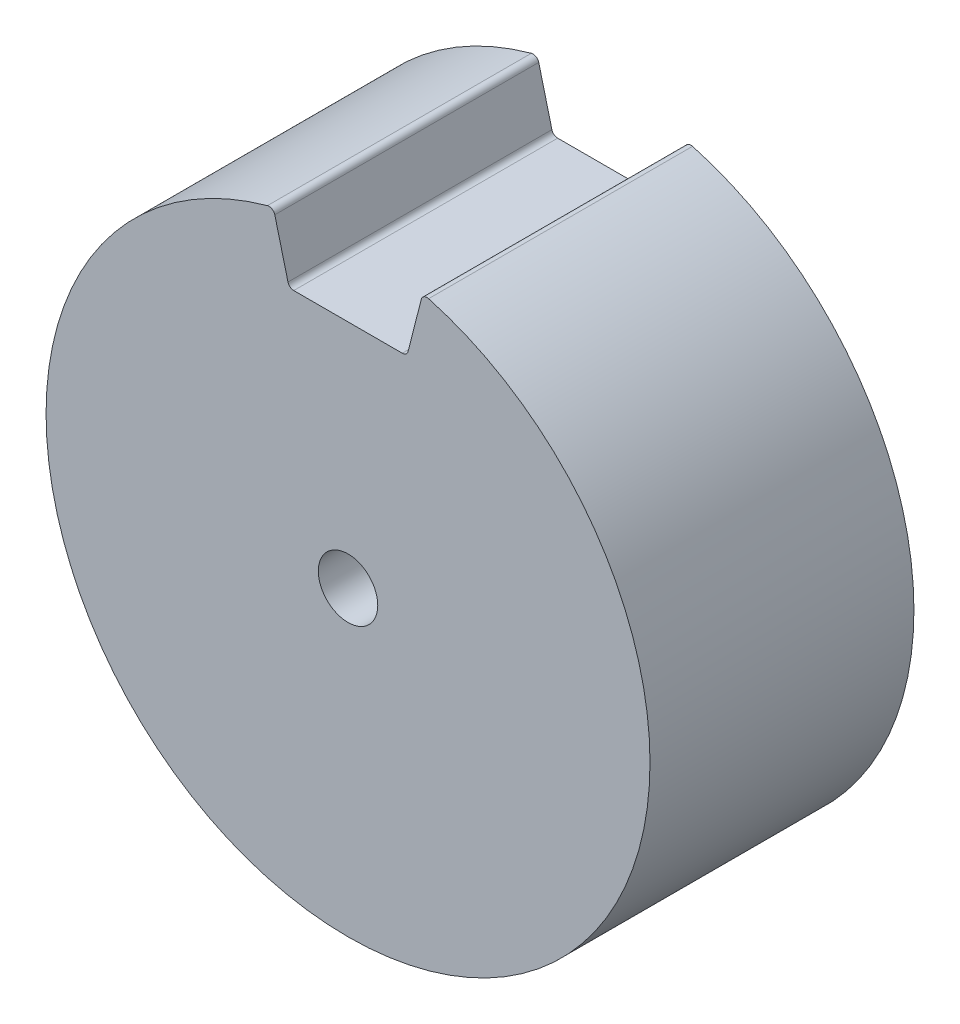
ISO-10303-21;
HEADER;
FILE_DESCRIPTION(('STEP AP214'),'2;1');
FILE_NAME('part.step','',(''),(''),'','','');
FILE_SCHEMA(('AUTOMOTIVE_DESIGN { 1 0 10303 214 1 1 1 1 }'));
ENDSEC;
DATA;
#1=APPLICATION_CONTEXT('core data for automotive mechanical design processes');
#2=APPLICATION_PROTOCOL_DEFINITION('international standard','automotive_design',2000,#1);
#3=PRODUCT_CONTEXT('',#1,'mechanical');
#4=PRODUCT('Part','Part','',(#3));
#5=PRODUCT_RELATED_PRODUCT_CATEGORY('part','',(#4));
#6=PRODUCT_DEFINITION_FORMATION('','',#4);
#7=PRODUCT_DEFINITION_CONTEXT('part definition',#1,'design');
#8=PRODUCT_DEFINITION('design','',#6,#7);
#9=PRODUCT_DEFINITION_SHAPE('','',#8);
#10=(LENGTH_UNIT() NAMED_UNIT(*) SI_UNIT(.MILLI.,.METRE.));
#11=(NAMED_UNIT(*) PLANE_ANGLE_UNIT() SI_UNIT($,.RADIAN.));
#12=(NAMED_UNIT(*) SI_UNIT($,.STERADIAN.) SOLID_ANGLE_UNIT());
#13=UNCERTAINTY_MEASURE_WITH_UNIT(LENGTH_MEASURE(1.E-05),#10,'distance_accuracy_value','');
#14=(GEOMETRIC_REPRESENTATION_CONTEXT(3) GLOBAL_UNCERTAINTY_ASSIGNED_CONTEXT((#13)) GLOBAL_UNIT_ASSIGNED_CONTEXT((#10,
#11,#12)) REPRESENTATION_CONTEXT('',''));
#15=CARTESIAN_POINT('',(0.,0.,0.));
#16=DIRECTION('',(0.,0.,1.));
#17=DIRECTION('',(1.,0.,0.));
#18=AXIS2_PLACEMENT_3D('',#15,#16,#17);
#19=CARTESIAN_POINT('',(0.,0.,22.2));
#20=DIRECTION('',(-0.968896057123284,-0.247468039332262,0.));
#21=DIRECTION('',(0.247468039332262,-0.968896057123284,0.));
#22=AXIS2_PLACEMENT_3D('',#19,#20,#21);
#23=PLANE('',#22);
#24=DIRECTION('',(-0.247468039332262,0.968896057123284,0.));
#25=VECTOR('',#24,1.);
#26=CARTESIAN_POINT('',(0.,0.,22.2));
#27=LINE('',#26,#25);
#28=CARTESIAN_POINT('',(-5.05110298621414,19.7762659803339,22.2));
#29=VERTEX_POINT('',#28);
#30=CARTESIAN_POINT('',(-6.16071174468288,24.1206473959329,22.2));
#31=VERTEX_POINT('',#30);
#32=EDGE_CURVE('E201',#29,#31,#27,.T.);
#33=ORIENTED_EDGE('',*,*,#32,.F.);
#34=DIRECTION('',(0.,0.,-1.));
#35=VECTOR('',#34,1.);
#36=CARTESIAN_POINT('',(-5.05110298621414,19.7762659803339,22.2));
#37=LINE('',#36,#35);
#38=CARTESIAN_POINT('',(-5.05110298621414,19.7762659803339,0.));
#39=VERTEX_POINT('',#38);
#40=EDGE_CURVE('E165',#29,#39,#37,.T.);
#41=ORIENTED_EDGE('',*,*,#40,.T.);
#42=DIRECTION('',(-0.247468039332262,0.968896057123284,0.));
#43=VECTOR('',#42,1.);
#44=CARTESIAN_POINT('',(0.,0.,0.));
#45=LINE('',#44,#43);
#46=CARTESIAN_POINT('',(-6.16071174468288,24.1206473959329,0.));
#47=VERTEX_POINT('',#46);
#48=EDGE_CURVE('E108',#39,#47,#45,.T.);
#49=ORIENTED_EDGE('',*,*,#48,.T.);
#50=DIRECTION('',(0.,0.,-1.));
#51=VECTOR('',#50,1.);
#52=CARTESIAN_POINT('',(-6.16071174468288,24.1206473959329,22.2));
#53=LINE('',#52,#51);
#54=EDGE_CURVE('E54',#47,#31,#53,.F.);
#55=ORIENTED_EDGE('',*,*,#54,.T.);
#56=EDGE_LOOP('',(#33,#41,#49,#55));
#57=FACE_BOUND('',#56,.T.);
#58=ADVANCED_FACE('F38',(#57),#23,.F.);
#59=CARTESIAN_POINT('',(0.,0.,22.2));
#60=DIRECTION('',(0.,0.,-1.));
#61=DIRECTION('',(-1.,0.,0.));
#62=AXIS2_PLACEMENT_3D('',#59,#60,#61);
#63=CYLINDRICAL_SURFACE('',#62,25.4);
#64=CARTESIAN_POINT('',(0.,0.,0.));
#65=DIRECTION('',(0.,0.,1.));
#66=DIRECTION('',(1.,0.,0.));
#67=AXIS2_PLACEMENT_3D('',#64,#65,#66);
#68=CIRCLE('',#67,25.4);
#69=CARTESIAN_POINT('',(-6.77859671648236,24.4787791067139,0.));
#70=VERTEX_POINT('',#69);
#71=CARTESIAN_POINT('',(6.77859671648235,24.4787791067139,0.));
#72=VERTEX_POINT('',#71);
#73=EDGE_CURVE('E185',#70,#72,#68,.T.);
#74=ORIENTED_EDGE('',*,*,#73,.T.);
#75=DIRECTION('',(0.,0.,-1.));
#76=VECTOR('',#75,1.);
#77=CARTESIAN_POINT('',(6.77859671648235,24.4787791067139,22.2));
#78=LINE('',#77,#76);
#79=CARTESIAN_POINT('',(6.77859671648235,24.4787791067139,22.2));
#80=VERTEX_POINT('',#79);
#81=EDGE_CURVE('E154',#72,#80,#78,.F.);
#82=ORIENTED_EDGE('',*,*,#81,.T.);
#83=CARTESIAN_POINT('',(0.,0.,22.2));
#84=DIRECTION('',(0.,0.,1.));
#85=DIRECTION('',(1.,0.,0.));
#86=AXIS2_PLACEMENT_3D('',#83,#84,#85);
#87=CIRCLE('',#86,25.4);
#88=CARTESIAN_POINT('',(-6.77859671648236,24.4787791067139,22.2));
#89=VERTEX_POINT('',#88);
#90=EDGE_CURVE('E198',#89,#80,#87,.T.);
#91=ORIENTED_EDGE('',*,*,#90,.F.);
#92=DIRECTION('',(0.,0.,-1.));
#93=VECTOR('',#92,1.);
#94=CARTESIAN_POINT('',(-6.77859671648236,24.4787791067139,22.2));
#95=LINE('',#94,#93);
#96=EDGE_CURVE('E150',#89,#70,#95,.T.);
#97=ORIENTED_EDGE('',*,*,#96,.T.);
#98=EDGE_LOOP('',(#74,#82,#91,#97));
#99=FACE_BOUND('',#98,.T.);
#100=ADVANCED_FACE('F221',(#99),#63,.T.);
#101=CARTESIAN_POINT('',(0.,0.,22.2));
#102=DIRECTION('',(-0.968896057123284,0.247468039332261,0.));
#103=DIRECTION('',(-0.247468039332261,-0.968896057123284,0.));
#104=AXIS2_PLACEMENT_3D('',#101,#102,#103);
#105=PLANE('',#104);
#106=DIRECTION('',(0.247468039332261,0.968896057123284,0.));
#107=VECTOR('',#106,1.);
#108=CARTESIAN_POINT('',(0.,0.,0.));
#109=LINE('',#108,#107);
#110=CARTESIAN_POINT('',(5.05110298621414,19.7762659803339,0.));
#111=VERTEX_POINT('',#110);
#112=CARTESIAN_POINT('',(6.16071174468287,24.1206473959329,0.));
#113=VERTEX_POINT('',#112);
#114=EDGE_CURVE('E124',#111,#113,#109,.T.);
#115=ORIENTED_EDGE('',*,*,#114,.F.);
#116=DIRECTION('',(0.,0.,-1.));
#117=VECTOR('',#116,1.);
#118=CARTESIAN_POINT('',(5.05110298621414,19.7762659803339,22.2));
#119=LINE('',#118,#117);
#120=CARTESIAN_POINT('',(5.05110298621414,19.7762659803339,22.2));
#121=VERTEX_POINT('',#120);
#122=EDGE_CURVE('E141',#111,#121,#119,.F.);
#123=ORIENTED_EDGE('',*,*,#122,.T.);
#124=DIRECTION('',(0.247468039332261,0.968896057123284,0.));
#125=VECTOR('',#124,1.);
#126=CARTESIAN_POINT('',(0.,0.,22.2));
#127=LINE('',#126,#125);
#128=CARTESIAN_POINT('',(6.16071174468287,24.1206473959329,22.2));
#129=VERTEX_POINT('',#128);
#130=EDGE_CURVE('E134',#121,#129,#127,.T.);
#131=ORIENTED_EDGE('',*,*,#130,.T.);
#132=DIRECTION('',(0.,0.,1.));
#133=VECTOR('',#132,1.);
#134=CARTESIAN_POINT('',(6.16071174468287,24.1206473959329,0.));
#135=LINE('',#134,#133);
#136=EDGE_CURVE('E132',#129,#113,#135,.F.);
#137=ORIENTED_EDGE('',*,*,#136,.T.);
#138=EDGE_LOOP('',(#115,#123,#131,#137));
#139=FACE_BOUND('',#138,.T.);
#140=ADVANCED_FACE('F182',(#139),#105,.T.);
#141=CARTESIAN_POINT('',(0.,0.,22.2));
#142=DIRECTION('',(0.,0.,-1.));
#143=DIRECTION('',(-1.,0.,0.));
#144=AXIS2_PLACEMENT_3D('',#141,#142,#143);
#145=CYLINDRICAL_SURFACE('',#144,2.5);
#146=CARTESIAN_POINT('',(0.,0.,22.2));
#147=DIRECTION('',(0.,0.,1.));
#148=DIRECTION('',(1.,0.,0.));
#149=AXIS2_PLACEMENT_3D('',#146,#147,#148);
#150=CIRCLE('',#149,2.5);
#151=CARTESIAN_POINT('',(2.5,0.,22.2));
#152=VERTEX_POINT('',#151);
#153=EDGE_CURVE('E123',#152,#152,#150,.T.);
#154=ORIENTED_EDGE('',*,*,#153,.T.);
#155=EDGE_LOOP('',(#154));
#156=FACE_BOUND('',#155,.T.);
#157=CARTESIAN_POINT('',(0.,0.,0.));
#158=DIRECTION('',(0.,0.,1.));
#159=DIRECTION('',(1.,0.,0.));
#160=AXIS2_PLACEMENT_3D('',#157,#158,#159);
#161=CIRCLE('',#160,2.5);
#162=CARTESIAN_POINT('',(2.5,0.,0.));
#163=VERTEX_POINT('',#162);
#164=EDGE_CURVE('E192',#163,#163,#161,.T.);
#165=ORIENTED_EDGE('',*,*,#164,.F.);
#166=EDGE_LOOP('',(#165));
#167=FACE_BOUND('',#166,.T.);
#168=ADVANCED_FACE('F208',(#156,#167),#145,.F.);
#169=CARTESIAN_POINT('',(0.,19.4,22.2));
#170=DIRECTION('',(0.,1.,0.));
#171=DIRECTION('',(0.,0.,1.));
#172=AXIS2_PLACEMENT_3D('',#169,#170,#171);
#173=PLANE('',#172);
#174=DIRECTION('',(1.,0.,0.));
#175=VECTOR('',#174,1.);
#176=CARTESIAN_POINT('',(0.,19.4,22.2));
#177=LINE('',#176,#175);
#178=CARTESIAN_POINT('',(-4.5666549576525,19.4,22.2));
#179=VERTEX_POINT('',#178);
#180=CARTESIAN_POINT('',(4.5666549576525,19.4,22.2));
#181=VERTEX_POINT('',#180);
#182=EDGE_CURVE('E128',#179,#181,#177,.T.);
#183=ORIENTED_EDGE('',*,*,#182,.T.);
#184=DIRECTION('',(0.,0.,-1.));
#185=VECTOR('',#184,1.);
#186=CARTESIAN_POINT('',(4.5666549576525,19.4,0.));
#187=LINE('',#186,#185);
#188=CARTESIAN_POINT('',(4.5666549576525,19.4,0.));
#189=VERTEX_POINT('',#188);
#190=EDGE_CURVE('E121',#181,#189,#187,.T.);
#191=ORIENTED_EDGE('',*,*,#190,.T.);
#192=DIRECTION('',(1.,0.,0.));
#193=VECTOR('',#192,1.);
#194=CARTESIAN_POINT('',(0.,19.4,0.));
#195=LINE('',#194,#193);
#196=CARTESIAN_POINT('',(-4.5666549576525,19.4,0.));
#197=VERTEX_POINT('',#196);
#198=EDGE_CURVE('E107',#197,#189,#195,.T.);
#199=ORIENTED_EDGE('',*,*,#198,.F.);
#200=DIRECTION('',(0.,0.,-1.));
#201=VECTOR('',#200,1.);
#202=CARTESIAN_POINT('',(-4.5666549576525,19.4,22.2));
#203=LINE('',#202,#201);
#204=EDGE_CURVE('E119',#197,#179,#203,.F.);
#205=ORIENTED_EDGE('',*,*,#204,.T.);
#206=EDGE_LOOP('',(#183,#191,#199,#205));
#207=FACE_BOUND('',#206,.T.);
#208=ADVANCED_FACE('F118',(#207),#173,.T.);
#209=CARTESIAN_POINT('',(0.,0.,22.2));
#210=DIRECTION('',(0.,0.,1.));
#211=DIRECTION('',(1.,0.,0.));
#212=AXIS2_PLACEMENT_3D('',#209,#210,#211);
#213=PLANE('',#212);
#214=ORIENTED_EDGE('',*,*,#153,.F.);
#215=EDGE_LOOP('',(#214));
#216=FACE_BOUND('',#215,.T.);
#217=ORIENTED_EDGE('',*,*,#90,.T.);
#218=CARTESIAN_POINT('',(6.64515977324451,23.9969133762668,22.2));
#219=DIRECTION('',(0.,0.,1.));
#220=DIRECTION('',(1.,0.,0.));
#221=AXIS2_PLACEMENT_3D('',#218,#219,#220);
#222=CIRCLE('',#221,0.5);
#223=EDGE_CURVE('E160',#80,#129,#222,.T.);
#224=ORIENTED_EDGE('',*,*,#223,.T.);
#225=ORIENTED_EDGE('',*,*,#130,.F.);
#226=CARTESIAN_POINT('',(4.5666549576525,19.9,22.2));
#227=DIRECTION('',(0.,0.,1.));
#228=DIRECTION('',(1.,0.,0.));
#229=AXIS2_PLACEMENT_3D('',#226,#227,#228);
#230=CIRCLE('',#229,0.5);
#231=EDGE_CURVE('E114',#121,#181,#230,.F.);
#232=ORIENTED_EDGE('',*,*,#231,.T.);
#233=ORIENTED_EDGE('',*,*,#182,.F.);
#234=CARTESIAN_POINT('',(-4.5666549576525,19.9,22.2));
#235=DIRECTION('',(0.,0.,1.));
#236=DIRECTION('',(1.,0.,0.));
#237=AXIS2_PLACEMENT_3D('',#234,#235,#236);
#238=CIRCLE('',#237,0.5);
#239=EDGE_CURVE('E11',#179,#29,#238,.F.);
#240=ORIENTED_EDGE('',*,*,#239,.T.);
#241=ORIENTED_EDGE('',*,*,#32,.T.);
#242=CARTESIAN_POINT('',(-6.64515977324452,23.9969133762668,22.2));
#243=DIRECTION('',(0.,0.,1.));
#244=DIRECTION('',(1.,0.,0.));
#245=AXIS2_PLACEMENT_3D('',#242,#243,#244);
#246=CIRCLE('',#245,0.5);
#247=EDGE_CURVE('E157',#31,#89,#246,.T.);
#248=ORIENTED_EDGE('',*,*,#247,.T.);
#249=EDGE_LOOP('',(#217,#224,#225,#232,#233,#240,#241,#248));
#250=FACE_BOUND('',#249,.T.);
#251=ADVANCED_FACE('F175',(#216,#250),#213,.T.);
#252=CARTESIAN_POINT('',(0.,0.,0.));
#253=DIRECTION('',(0.,0.,1.));
#254=DIRECTION('',(1.,0.,0.));
#255=AXIS2_PLACEMENT_3D('',#252,#253,#254);
#256=PLANE('',#255);
#257=ORIENTED_EDGE('',*,*,#164,.T.);
#258=EDGE_LOOP('',(#257));
#259=FACE_BOUND('',#258,.T.);
#260=ORIENTED_EDGE('',*,*,#114,.T.);
#261=CARTESIAN_POINT('',(6.64515977324451,23.9969133762668,0.));
#262=DIRECTION('',(0.,0.,1.));
#263=DIRECTION('',(1.,0.,0.));
#264=AXIS2_PLACEMENT_3D('',#261,#262,#263);
#265=CIRCLE('',#264,0.5);
#266=EDGE_CURVE('E147',#113,#72,#265,.F.);
#267=ORIENTED_EDGE('',*,*,#266,.T.);
#268=ORIENTED_EDGE('',*,*,#73,.F.);
#269=CARTESIAN_POINT('',(-6.64515977324452,23.9969133762668,0.));
#270=DIRECTION('',(0.,0.,1.));
#271=DIRECTION('',(1.,0.,0.));
#272=AXIS2_PLACEMENT_3D('',#269,#270,#271);
#273=CIRCLE('',#272,0.5);
#274=EDGE_CURVE('E144',#70,#47,#273,.F.);
#275=ORIENTED_EDGE('',*,*,#274,.T.);
#276=ORIENTED_EDGE('',*,*,#48,.F.);
#277=CARTESIAN_POINT('',(-4.5666549576525,19.9,0.));
#278=DIRECTION('',(0.,0.,1.));
#279=DIRECTION('',(1.,0.,0.));
#280=AXIS2_PLACEMENT_3D('',#277,#278,#279);
#281=CIRCLE('',#280,0.5);
#282=EDGE_CURVE('E47',#39,#197,#281,.T.);
#283=ORIENTED_EDGE('',*,*,#282,.T.);
#284=ORIENTED_EDGE('',*,*,#198,.T.);
#285=CARTESIAN_POINT('',(4.5666549576525,19.9,0.));
#286=DIRECTION('',(0.,0.,1.));
#287=DIRECTION('',(1.,0.,0.));
#288=AXIS2_PLACEMENT_3D('',#285,#286,#287);
#289=CIRCLE('',#288,0.5);
#290=EDGE_CURVE('E168',#189,#111,#289,.T.);
#291=ORIENTED_EDGE('',*,*,#290,.T.);
#292=EDGE_LOOP('',(#260,#267,#268,#275,#276,#283,#284,#291));
#293=FACE_BOUND('',#292,.T.);
#294=ADVANCED_FACE('F106',(#259,#293),#256,.F.);
#295=CARTESIAN_POINT('',(4.5666549576525,19.9,22.2));
#296=DIRECTION('',(0.,0.,1.));
#297=DIRECTION('',(1.,0.,0.));
#298=AXIS2_PLACEMENT_3D('',#295,#296,#297);
#299=CYLINDRICAL_SURFACE('',#298,0.5);
#300=ORIENTED_EDGE('',*,*,#231,.F.);
#301=ORIENTED_EDGE('',*,*,#122,.F.);
#302=ORIENTED_EDGE('',*,*,#290,.F.);
#303=ORIENTED_EDGE('',*,*,#190,.F.);
#304=EDGE_LOOP('',(#300,#301,#302,#303));
#305=FACE_BOUND('',#304,.T.);
#306=ADVANCED_FACE('F179',(#305),#299,.F.);
#307=CARTESIAN_POINT('',(6.64515977324451,23.9969133762668,22.2));
#308=DIRECTION('',(0.,0.,-1.));
#309=DIRECTION('',(-1.,0.,0.));
#310=AXIS2_PLACEMENT_3D('',#307,#308,#309);
#311=CYLINDRICAL_SURFACE('',#310,0.5);
#312=ORIENTED_EDGE('',*,*,#223,.F.);
#313=ORIENTED_EDGE('',*,*,#81,.F.);
#314=ORIENTED_EDGE('',*,*,#266,.F.);
#315=ORIENTED_EDGE('',*,*,#136,.F.);
#316=EDGE_LOOP('',(#312,#313,#314,#315));
#317=FACE_BOUND('',#316,.T.);
#318=ADVANCED_FACE('F235',(#317),#311,.T.);
#319=CARTESIAN_POINT('',(-4.5666549576525,19.9,22.2));
#320=DIRECTION('',(0.,0.,-1.));
#321=DIRECTION('',(-1.,0.,0.));
#322=AXIS2_PLACEMENT_3D('',#319,#320,#321);
#323=CYLINDRICAL_SURFACE('',#322,0.5);
#324=ORIENTED_EDGE('',*,*,#239,.F.);
#325=ORIENTED_EDGE('',*,*,#204,.F.);
#326=ORIENTED_EDGE('',*,*,#282,.F.);
#327=ORIENTED_EDGE('',*,*,#40,.F.);
#328=EDGE_LOOP('',(#324,#325,#326,#327));
#329=FACE_BOUND('',#328,.T.);
#330=ADVANCED_FACE('F126',(#329),#323,.F.);
#331=CARTESIAN_POINT('',(-6.64515977324452,23.9969133762668,22.2));
#332=DIRECTION('',(0.,0.,-1.));
#333=DIRECTION('',(-1.,0.,0.));
#334=AXIS2_PLACEMENT_3D('',#331,#332,#333);
#335=CYLINDRICAL_SURFACE('',#334,0.5);
#336=ORIENTED_EDGE('',*,*,#247,.F.);
#337=ORIENTED_EDGE('',*,*,#54,.F.);
#338=ORIENTED_EDGE('',*,*,#274,.F.);
#339=ORIENTED_EDGE('',*,*,#96,.F.);
#340=EDGE_LOOP('',(#336,#337,#338,#339));
#341=FACE_BOUND('',#340,.T.);
#342=ADVANCED_FACE('F40',(#341),#335,.T.);
#343=CLOSED_SHELL('',(#58,#100,#140,#168,#208,#251,#294,#306,#318,#330,#342));
#344=MANIFOLD_SOLID_BREP('B2',#343);
#345=ADVANCED_BREP_SHAPE_REPRESENTATION('',(#18,#344),#14);
#346=SHAPE_DEFINITION_REPRESENTATION(#9,#345);
ENDSEC;
END-ISO-10303-21;
